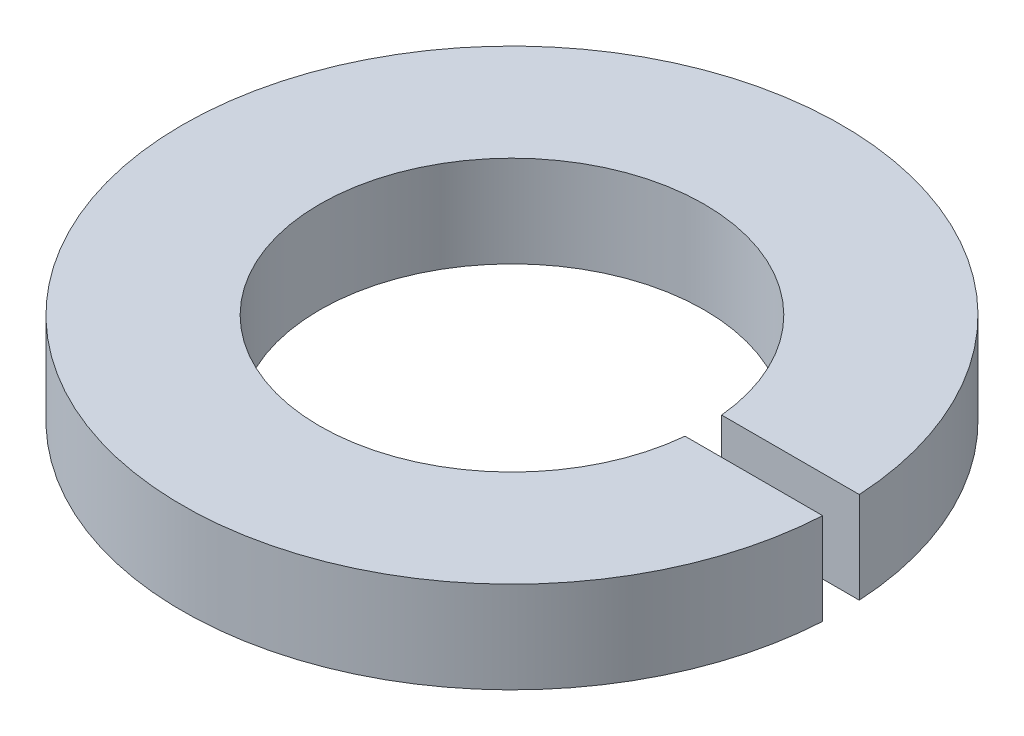
ISO-10303-21;
HEADER;
FILE_DESCRIPTION(('STEP AP214'),'2;1');
FILE_NAME('part.step','',(''),(''),'','','');
FILE_SCHEMA(('AUTOMOTIVE_DESIGN { 1 0 10303 214 1 1 1 1 }'));
ENDSEC;
DATA;
#1=APPLICATION_CONTEXT('core data for automotive mechanical design processes');
#2=APPLICATION_PROTOCOL_DEFINITION('international standard','automotive_design',2000,#1);
#3=PRODUCT_CONTEXT('',#1,'mechanical');
#4=PRODUCT('Part','Part','',(#3));
#5=PRODUCT_RELATED_PRODUCT_CATEGORY('part','',(#4));
#6=PRODUCT_DEFINITION_FORMATION('','',#4);
#7=PRODUCT_DEFINITION_CONTEXT('part definition',#1,'design');
#8=PRODUCT_DEFINITION('design','',#6,#7);
#9=PRODUCT_DEFINITION_SHAPE('','',#8);
#10=(LENGTH_UNIT() NAMED_UNIT(*) SI_UNIT(.MILLI.,.METRE.));
#11=(NAMED_UNIT(*) PLANE_ANGLE_UNIT() SI_UNIT($,.RADIAN.));
#12=(NAMED_UNIT(*) SI_UNIT($,.STERADIAN.) SOLID_ANGLE_UNIT());
#13=UNCERTAINTY_MEASURE_WITH_UNIT(LENGTH_MEASURE(1.E-05),#10,'distance_accuracy_value','');
#14=(GEOMETRIC_REPRESENTATION_CONTEXT(3) GLOBAL_UNCERTAINTY_ASSIGNED_CONTEXT((#13)) GLOBAL_UNIT_ASSIGNED_CONTEXT((#10,
#11,#12)) REPRESENTATION_CONTEXT('',''));
#15=CARTESIAN_POINT('',(0.,0.,0.));
#16=DIRECTION('',(0.,0.,1.));
#17=DIRECTION('',(1.,0.,0.));
#18=AXIS2_PLACEMENT_3D('',#15,#16,#17);
#19=CARTESIAN_POINT('',(0.,1.,0.));
#20=DIRECTION('',(0.,1.,0.));
#21=DIRECTION('',(0.,0.,1.));
#22=AXIS2_PLACEMENT_3D('',#19,#20,#21);
#23=PLANE('',#22);
#24=DIRECTION('',(1.,0.,0.));
#25=VECTOR('',#24,1.);
#26=CARTESIAN_POINT('',(2.,1.,0.2));
#27=LINE('',#26,#25);
#28=CARTESIAN_POINT('',(3.59444015112229,1.,0.2));
#29=VERTEX_POINT('',#28);
#30=CARTESIAN_POINT('',(2.09045449603669,1.,0.2));
#31=VERTEX_POINT('',#30);
#32=EDGE_CURVE('E59',#29,#31,#27,.F.);
#33=ORIENTED_EDGE('',*,*,#32,.T.);
#34=CARTESIAN_POINT('',(0.,1.,0.));
#35=DIRECTION('',(0.,-1.,0.));
#36=DIRECTION('',(0.,0.,-1.));
#37=AXIS2_PLACEMENT_3D('',#34,#35,#36);
#38=CIRCLE('',#37,2.1);
#39=CARTESIAN_POINT('',(2.09045449603669,1.,-0.2));
#40=VERTEX_POINT('',#39);
#41=EDGE_CURVE('E19',#31,#40,#38,.T.);
#42=ORIENTED_EDGE('',*,*,#41,.T.);
#43=DIRECTION('',(-1.,0.,0.));
#44=VECTOR('',#43,1.);
#45=CARTESIAN_POINT('',(2.,1.,-0.2));
#46=LINE('',#45,#44);
#47=CARTESIAN_POINT('',(3.59444015112229,1.,-0.2));
#48=VERTEX_POINT('',#47);
#49=EDGE_CURVE('E62',#40,#48,#46,.F.);
#50=ORIENTED_EDGE('',*,*,#49,.T.);
#51=CARTESIAN_POINT('',(0.,1.,0.));
#52=DIRECTION('',(0.,-1.,0.));
#53=DIRECTION('',(0.,0.,-1.));
#54=AXIS2_PLACEMENT_3D('',#51,#52,#53);
#55=CIRCLE('',#54,3.6);
#56=EDGE_CURVE('E57',#29,#48,#55,.T.);
#57=ORIENTED_EDGE('',*,*,#56,.F.);
#58=EDGE_LOOP('',(#33,#42,#50,#57));
#59=FACE_BOUND('',#58,.T.);
#60=ADVANCED_FACE('F16',(#59),#23,.T.);
#61=CARTESIAN_POINT('',(2.,0.,0.2));
#62=DIRECTION('',(0.,0.,1.));
#63=DIRECTION('',(1.,0.,0.));
#64=AXIS2_PLACEMENT_3D('',#61,#62,#63);
#65=PLANE('',#64);
#66=DIRECTION('',(0.,-1.,0.));
#67=VECTOR('',#66,1.);
#68=CARTESIAN_POINT('',(2.09045449603669,1.,0.2));
#69=LINE('',#68,#67);
#70=CARTESIAN_POINT('',(2.09045449603669,0.,0.2));
#71=VERTEX_POINT('',#70);
#72=EDGE_CURVE('E72',#71,#31,#69,.F.);
#73=ORIENTED_EDGE('',*,*,#72,.T.);
#74=ORIENTED_EDGE('',*,*,#32,.F.);
#75=DIRECTION('',(0.,1.,0.));
#76=VECTOR('',#75,1.);
#77=CARTESIAN_POINT('',(3.59444015112229,0.,0.2));
#78=LINE('',#77,#76);
#79=CARTESIAN_POINT('',(3.59444015112229,0.,0.2));
#80=VERTEX_POINT('',#79);
#81=EDGE_CURVE('E71',#80,#29,#78,.T.);
#82=ORIENTED_EDGE('',*,*,#81,.F.);
#83=DIRECTION('',(1.,0.,0.));
#84=VECTOR('',#83,1.);
#85=CARTESIAN_POINT('',(0.,0.,0.2));
#86=LINE('',#85,#84);
#87=EDGE_CURVE('E82',#80,#71,#86,.F.);
#88=ORIENTED_EDGE('',*,*,#87,.T.);
#89=EDGE_LOOP('',(#73,#74,#82,#88));
#90=FACE_BOUND('',#89,.T.);
#91=ADVANCED_FACE('F69',(#90),#65,.F.);
#92=CARTESIAN_POINT('',(0.,1.,0.));
#93=DIRECTION('',(0.,-1.,0.));
#94=DIRECTION('',(0.,0.,-1.));
#95=AXIS2_PLACEMENT_3D('',#92,#93,#94);
#96=CYLINDRICAL_SURFACE('',#95,2.1);
#97=ORIENTED_EDGE('',*,*,#41,.F.);
#98=ORIENTED_EDGE('',*,*,#72,.F.);
#99=CARTESIAN_POINT('',(0.,0.,0.));
#100=DIRECTION('',(0.,-1.,0.));
#101=DIRECTION('',(0.,0.,-1.));
#102=AXIS2_PLACEMENT_3D('',#99,#100,#101);
#103=CIRCLE('',#102,2.1);
#104=CARTESIAN_POINT('',(2.09045449603669,0.,-0.2));
#105=VERTEX_POINT('',#104);
#106=EDGE_CURVE('E25',#71,#105,#103,.T.);
#107=ORIENTED_EDGE('',*,*,#106,.T.);
#108=DIRECTION('',(0.,1.,0.));
#109=VECTOR('',#108,1.);
#110=CARTESIAN_POINT('',(2.09045449603669,0.,-0.2));
#111=LINE('',#110,#109);
#112=EDGE_CURVE('E79',#105,#40,#111,.T.);
#113=ORIENTED_EDGE('',*,*,#112,.T.);
#114=EDGE_LOOP('',(#97,#98,#107,#113));
#115=FACE_BOUND('',#114,.T.);
#116=ADVANCED_FACE('F90',(#115),#96,.F.);
#117=CARTESIAN_POINT('',(2.,0.,-0.2));
#118=DIRECTION('',(0.,0.,-1.));
#119=DIRECTION('',(-1.,0.,0.));
#120=AXIS2_PLACEMENT_3D('',#117,#118,#119);
#121=PLANE('',#120);
#122=ORIENTED_EDGE('',*,*,#112,.F.);
#123=DIRECTION('',(1.,0.,0.));
#124=VECTOR('',#123,1.);
#125=CARTESIAN_POINT('',(0.,0.,-0.2));
#126=LINE('',#125,#124);
#127=CARTESIAN_POINT('',(3.59444015112229,0.,-0.2));
#128=VERTEX_POINT('',#127);
#129=EDGE_CURVE('E11',#105,#128,#126,.T.);
#130=ORIENTED_EDGE('',*,*,#129,.T.);
#131=DIRECTION('',(0.,-1.,0.));
#132=VECTOR('',#131,1.);
#133=CARTESIAN_POINT('',(3.59444015112229,1.,-0.2));
#134=LINE('',#133,#132);
#135=EDGE_CURVE('E66',#48,#128,#134,.T.);
#136=ORIENTED_EDGE('',*,*,#135,.F.);
#137=ORIENTED_EDGE('',*,*,#49,.F.);
#138=EDGE_LOOP('',(#122,#130,#136,#137));
#139=FACE_BOUND('',#138,.T.);
#140=ADVANCED_FACE('F87',(#139),#121,.F.);
#141=CARTESIAN_POINT('',(0.,1.,0.));
#142=DIRECTION('',(0.,-1.,0.));
#143=DIRECTION('',(0.,0.,-1.));
#144=AXIS2_PLACEMENT_3D('',#141,#142,#143);
#145=CYLINDRICAL_SURFACE('',#144,3.6);
#146=ORIENTED_EDGE('',*,*,#135,.T.);
#147=CARTESIAN_POINT('',(0.,0.,0.));
#148=DIRECTION('',(0.,-1.,0.));
#149=DIRECTION('',(0.,0.,-1.));
#150=AXIS2_PLACEMENT_3D('',#147,#148,#149);
#151=CIRCLE('',#150,3.6);
#152=EDGE_CURVE('E34',#128,#80,#151,.F.);
#153=ORIENTED_EDGE('',*,*,#152,.T.);
#154=ORIENTED_EDGE('',*,*,#81,.T.);
#155=ORIENTED_EDGE('',*,*,#56,.T.);
#156=EDGE_LOOP('',(#146,#153,#154,#155));
#157=FACE_BOUND('',#156,.T.);
#158=ADVANCED_FACE('F74',(#157),#145,.T.);
#159=CARTESIAN_POINT('',(0.,0.,0.));
#160=DIRECTION('',(0.,1.,0.));
#161=DIRECTION('',(0.,0.,1.));
#162=AXIS2_PLACEMENT_3D('',#159,#160,#161);
#163=PLANE('',#162);
#164=ORIENTED_EDGE('',*,*,#129,.F.);
#165=ORIENTED_EDGE('',*,*,#106,.F.);
#166=ORIENTED_EDGE('',*,*,#87,.F.);
#167=ORIENTED_EDGE('',*,*,#152,.F.);
#168=EDGE_LOOP('',(#164,#165,#166,#167));
#169=FACE_BOUND('',#168,.T.);
#170=ADVANCED_FACE('F89',(#169),#163,.F.);
#171=CLOSED_SHELL('',(#60,#91,#116,#140,#158,#170));
#172=MANIFOLD_SOLID_BREP('B1',#171);
#173=ADVANCED_BREP_SHAPE_REPRESENTATION('',(#18,#172),#14);
#174=SHAPE_DEFINITION_REPRESENTATION(#9,#173);
ENDSEC;
END-ISO-10303-21;
